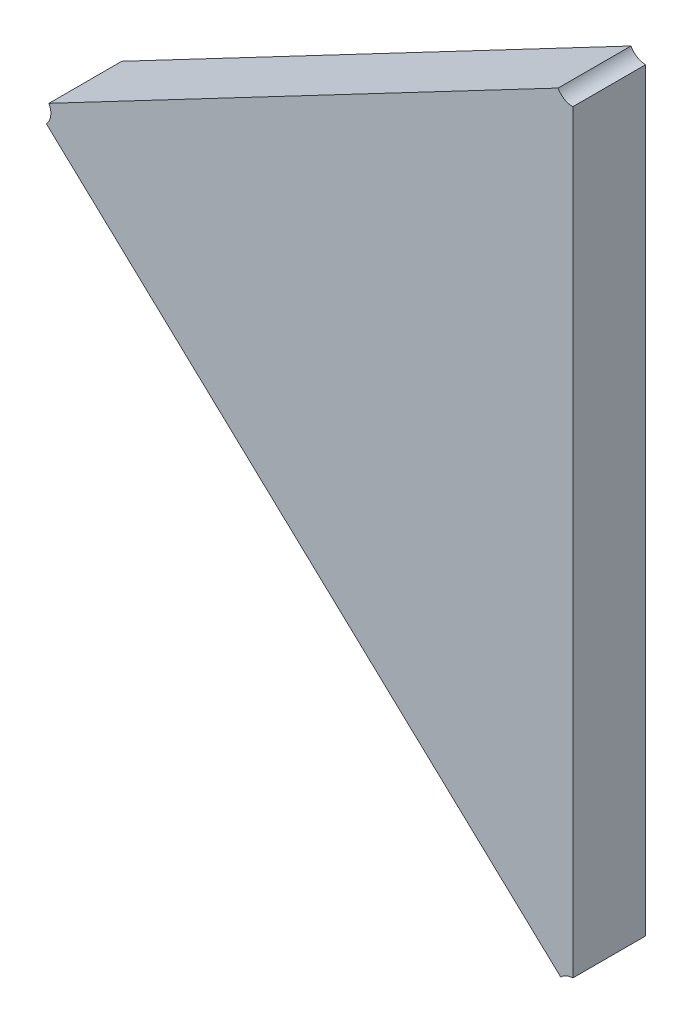
ISO-10303-21;
HEADER;
FILE_DESCRIPTION(('STEP AP214'),'2;1');
FILE_NAME('part.step','',(''),(''),'','','');
FILE_SCHEMA(('AUTOMOTIVE_DESIGN { 1 0 10303 214 1 1 1 1 }'));
ENDSEC;
DATA;
#1=APPLICATION_CONTEXT('core data for automotive mechanical design processes');
#2=APPLICATION_PROTOCOL_DEFINITION('international standard','automotive_design',2000,#1);
#3=PRODUCT_CONTEXT('',#1,'mechanical');
#4=PRODUCT('Part','Part','',(#3));
#5=PRODUCT_RELATED_PRODUCT_CATEGORY('part','',(#4));
#6=PRODUCT_DEFINITION_FORMATION('','',#4);
#7=PRODUCT_DEFINITION_CONTEXT('part definition',#1,'design');
#8=PRODUCT_DEFINITION('design','',#6,#7);
#9=PRODUCT_DEFINITION_SHAPE('','',#8);
#10=(LENGTH_UNIT() NAMED_UNIT(*) SI_UNIT(.MILLI.,.METRE.));
#11=(NAMED_UNIT(*) PLANE_ANGLE_UNIT() SI_UNIT($,.RADIAN.));
#12=(NAMED_UNIT(*) SI_UNIT($,.STERADIAN.) SOLID_ANGLE_UNIT());
#13=UNCERTAINTY_MEASURE_WITH_UNIT(LENGTH_MEASURE(1.E-05),#10,'distance_accuracy_value','');
#14=(GEOMETRIC_REPRESENTATION_CONTEXT(3) GLOBAL_UNCERTAINTY_ASSIGNED_CONTEXT((#13)) GLOBAL_UNIT_ASSIGNED_CONTEXT((#10,
#11,#12)) REPRESENTATION_CONTEXT('',''));
#15=CARTESIAN_POINT('',(0.,0.,0.));
#16=DIRECTION('',(0.,0.,1.));
#17=DIRECTION('',(1.,0.,0.));
#18=AXIS2_PLACEMENT_3D('',#15,#16,#17);
#19=CARTESIAN_POINT('',(-1.3140543489609,-1.308653002537,0.00415));
#20=DIRECTION('',(0.,0.,1.));
#21=DIRECTION('',(1.,0.,0.));
#22=AXIS2_PLACEMENT_3D('',#19,#20,#21);
#23=PLANE('',#22);
#24=CARTESIAN_POINT('',(-1.3063434907431,-1.2918616528766,0.00415));
#25=DIRECTION('',(0.,0.,-1.));
#26=DIRECTION('',(0.885039467737987,0.465515993867086,0.));
#27=AXIS2_PLACEMENT_3D('',#24,#25,#26);
#28=CIRCLE('',#27,0.000750000000000008);
#29=CARTESIAN_POINT('',(-1.3063434907431,-1.2926116528766,0.00415));
#30=VERTEX_POINT('',#29);
#31=CARTESIAN_POINT('',(-1.3070072703439,-1.292210789872,0.00415));
#32=VERTEX_POINT('',#31);
#33=EDGE_CURVE('E11',#30,#32,#28,.T.);
#34=ORIENTED_EDGE('',*,*,#33,.T.);
#35=DIRECTION('',(-0.885039467737862,-0.465515993867324,0.));
#36=VECTOR('',#35,1.);
#37=CARTESIAN_POINT('',(-1.3070072703439,-1.292210789872,0.00415));
#38=LINE('',#37,#36);
#39=CARTESIAN_POINT('',(-1.3300806673264,-1.304347011724,0.00415));
#40=VERTEX_POINT('',#39);
#41=EDGE_CURVE('E24',#32,#40,#38,.T.);
#42=ORIENTED_EDGE('',*,*,#41,.T.);
#43=CARTESIAN_POINT('',(-1.3307444469272,-1.3046961487194,0.00415));
#44=DIRECTION('',(0.,0.,-1.));
#45=DIRECTION('',(-0.729821846781365,0.683637383384377,0.));
#46=AXIS2_PLACEMENT_3D('',#43,#44,#45);
#47=CIRCLE('',#46,0.000750000000000006);
#48=CARTESIAN_POINT('',(-1.3301970805421,-1.3052088767569,0.00415));
#49=VERTEX_POINT('',#48);
#50=EDGE_CURVE('E86',#40,#49,#47,.T.);
#51=ORIENTED_EDGE('',*,*,#50,.T.);
#52=DIRECTION('',(0.72982184678132,-0.683637383384425,0.));
#53=VECTOR('',#52,1.);
#54=CARTESIAN_POINT('',(-1.3301970805421,-1.3052088767569,0.00415));
#55=LINE('',#54,#53);
#56=CARTESIAN_POINT('',(-1.3068908571282,-1.3270402396594,0.00415));
#57=VERTEX_POINT('',#56);
#58=EDGE_CURVE('E107',#49,#57,#55,.T.);
#59=ORIENTED_EDGE('',*,*,#58,.T.);
#60=CARTESIAN_POINT('',(-1.3063434907431,-1.327552967697,0.00415));
#61=DIRECTION('',(0.,0.,-1.));
#62=DIRECTION('',(0.,-1.,0.));
#63=AXIS2_PLACEMENT_3D('',#60,#61,#62);
#64=CIRCLE('',#63,0.000750000000000008);
#65=CARTESIAN_POINT('',(-1.3063434907431,-1.326802967697,0.00415));
#66=VERTEX_POINT('',#65);
#67=EDGE_CURVE('E105',#57,#66,#64,.T.);
#68=ORIENTED_EDGE('',*,*,#67,.T.);
#69=DIRECTION('',(0.,1.,0.));
#70=VECTOR('',#69,1.);
#71=CARTESIAN_POINT('',(-1.3063434907431,-1.326802967697,0.00415));
#72=LINE('',#71,#70);
#73=EDGE_CURVE('E103',#66,#30,#72,.T.);
#74=ORIENTED_EDGE('',*,*,#73,.T.);
#75=EDGE_LOOP('',(#34,#42,#51,#59,#68,#74));
#76=FACE_BOUND('',#75,.T.);
#77=ADVANCED_FACE('F17',(#76),#23,.T.);
#78=CARTESIAN_POINT('',(-1.3140406647502,-1.3086676431187,0.00085));
#79=DIRECTION('',(0.,0.,1.));
#80=DIRECTION('',(1.,0.,0.));
#81=AXIS2_PLACEMENT_3D('',#78,#79,#80);
#82=PLANE('',#81);
#83=CARTESIAN_POINT('',(-1.3063434907431,-1.2918616528766,0.00085));
#84=DIRECTION('',(0.,0.,1.));
#85=DIRECTION('',(-1.,0.,0.));
#86=AXIS2_PLACEMENT_3D('',#83,#84,#85);
#87=CIRCLE('',#86,0.000750000000000008);
#88=CARTESIAN_POINT('',(-1.3070072703439,-1.292210789872,0.00085));
#89=VERTEX_POINT('',#88);
#90=CARTESIAN_POINT('',(-1.3063434907431,-1.2926116528766,0.00085));
#91=VERTEX_POINT('',#90);
#92=EDGE_CURVE('E101',#89,#91,#87,.T.);
#93=ORIENTED_EDGE('',*,*,#92,.T.);
#94=DIRECTION('',(0.,1.,0.));
#95=VECTOR('',#94,1.);
#96=CARTESIAN_POINT('',(-1.3063434907431,-1.327552967697,0.00085));
#97=LINE('',#96,#95);
#98=CARTESIAN_POINT('',(-1.3063434907431,-1.326802967697,0.00085));
#99=VERTEX_POINT('',#98);
#100=EDGE_CURVE('E98',#99,#91,#97,.T.);
#101=ORIENTED_EDGE('',*,*,#100,.F.);
#102=CARTESIAN_POINT('',(-1.3063434907431,-1.327552967697,0.00085));
#103=DIRECTION('',(0.,0.,1.));
#104=DIRECTION('',(-1.,0.,0.));
#105=AXIS2_PLACEMENT_3D('',#102,#103,#104);
#106=CIRCLE('',#105,0.000750000000000008);
#107=CARTESIAN_POINT('',(-1.3068908571282,-1.3270402396594,0.00085));
#108=VERTEX_POINT('',#107);
#109=EDGE_CURVE('E96',#99,#108,#106,.T.);
#110=ORIENTED_EDGE('',*,*,#109,.T.);
#111=DIRECTION('',(0.729821846781321,-0.683637383384425,0.));
#112=VECTOR('',#111,1.);
#113=CARTESIAN_POINT('',(-1.3307444469272,-1.3046961487194,0.00085));
#114=LINE('',#113,#112);
#115=CARTESIAN_POINT('',(-1.3301970805421,-1.3052088767569,0.00085));
#116=VERTEX_POINT('',#115);
#117=EDGE_CURVE('E72',#116,#108,#114,.T.);
#118=ORIENTED_EDGE('',*,*,#117,.F.);
#119=CARTESIAN_POINT('',(-1.3307444469272,-1.3046961487194,0.00085));
#120=DIRECTION('',(0.,0.,1.));
#121=DIRECTION('',(-1.,0.,0.));
#122=AXIS2_PLACEMENT_3D('',#119,#120,#121);
#123=CIRCLE('',#122,0.000750000000000006);
#124=CARTESIAN_POINT('',(-1.3300806673264,-1.304347011724,0.00085));
#125=VERTEX_POINT('',#124);
#126=EDGE_CURVE('E66',#116,#125,#123,.T.);
#127=ORIENTED_EDGE('',*,*,#126,.T.);
#128=DIRECTION('',(-0.885039467737862,-0.465515993867324,0.));
#129=VECTOR('',#128,1.);
#130=CARTESIAN_POINT('',(-1.3063434907431,-1.2918616528766,0.00085));
#131=LINE('',#130,#129);
#132=EDGE_CURVE('E69',#89,#125,#131,.T.);
#133=ORIENTED_EDGE('',*,*,#132,.F.);
#134=EDGE_LOOP('',(#93,#101,#110,#118,#127,#133));
#135=FACE_BOUND('',#134,.T.);
#136=ADVANCED_FACE('F68',(#135),#82,.F.);
#137=CARTESIAN_POINT('',(-1.3063434907431,-1.2918616528766,0.00085));
#138=DIRECTION('',(-0.465515993867324,0.885039467737862,0.));
#139=DIRECTION('',(-0.885039467737862,-0.465515993867324,0.));
#140=AXIS2_PLACEMENT_3D('',#137,#138,#139);
#141=PLANE('',#140);
#142=DIRECTION('',(0.,0.,-1.));
#143=VECTOR('',#142,1.);
#144=CARTESIAN_POINT('',(-1.3070072703439,-1.292210789872,0.00115));
#145=LINE('',#144,#143);
#146=EDGE_CURVE('E82',#32,#89,#145,.T.);
#147=ORIENTED_EDGE('',*,*,#146,.T.);
#148=ORIENTED_EDGE('',*,*,#132,.T.);
#149=DIRECTION('',(0.,0.,1.));
#150=VECTOR('',#149,1.);
#151=CARTESIAN_POINT('',(-1.3300806673264,-1.304347011724,0.00115));
#152=LINE('',#151,#150);
#153=EDGE_CURVE('E81',#125,#40,#152,.T.);
#154=ORIENTED_EDGE('',*,*,#153,.T.);
#155=ORIENTED_EDGE('',*,*,#41,.F.);
#156=EDGE_LOOP('',(#147,#148,#154,#155));
#157=FACE_BOUND('',#156,.T.);
#158=ADVANCED_FACE('F80',(#157),#141,.T.);
#159=CARTESIAN_POINT('',(-1.3307444469272,-1.3046961487194,0.00085));
#160=DIRECTION('',(-0.683637383384425,-0.729821846781321,0.));
#161=DIRECTION('',(0.729821846781321,-0.683637383384425,0.));
#162=AXIS2_PLACEMENT_3D('',#159,#160,#161);
#163=PLANE('',#162);
#164=DIRECTION('',(0.,0.,1.));
#165=VECTOR('',#164,1.);
#166=CARTESIAN_POINT('',(-1.3068908571282,-1.3270402396594,0.00115));
#167=LINE('',#166,#165);
#168=EDGE_CURVE('E87',#108,#57,#167,.T.);
#169=ORIENTED_EDGE('',*,*,#168,.T.);
#170=ORIENTED_EDGE('',*,*,#58,.F.);
#171=DIRECTION('',(0.,0.,-1.));
#172=VECTOR('',#171,1.);
#173=CARTESIAN_POINT('',(-1.3301970805421,-1.3052088767569,0.00115));
#174=LINE('',#173,#172);
#175=EDGE_CURVE('E91',#49,#116,#174,.T.);
#176=ORIENTED_EDGE('',*,*,#175,.T.);
#177=ORIENTED_EDGE('',*,*,#117,.T.);
#178=EDGE_LOOP('',(#169,#170,#176,#177));
#179=FACE_BOUND('',#178,.T.);
#180=ADVANCED_FACE('F125',(#179),#163,.T.);
#181=CARTESIAN_POINT('',(-1.3063434907431,-1.327552967697,0.00085));
#182=DIRECTION('',(1.,0.,0.));
#183=DIRECTION('',(0.,1.,0.));
#184=AXIS2_PLACEMENT_3D('',#181,#182,#183);
#185=PLANE('',#184);
#186=DIRECTION('',(0.,0.,1.));
#187=VECTOR('',#186,1.);
#188=CARTESIAN_POINT('',(-1.3063434907431,-1.2926116528766,0.00115));
#189=LINE('',#188,#187);
#190=EDGE_CURVE('E112',#91,#30,#189,.T.);
#191=ORIENTED_EDGE('',*,*,#190,.T.);
#192=ORIENTED_EDGE('',*,*,#73,.F.);
#193=DIRECTION('',(0.,0.,-1.));
#194=VECTOR('',#193,1.);
#195=CARTESIAN_POINT('',(-1.3063434907431,-1.326802967697,0.00115));
#196=LINE('',#195,#194);
#197=EDGE_CURVE('E119',#66,#99,#196,.T.);
#198=ORIENTED_EDGE('',*,*,#197,.T.);
#199=ORIENTED_EDGE('',*,*,#100,.T.);
#200=EDGE_LOOP('',(#191,#192,#198,#199));
#201=FACE_BOUND('',#200,.T.);
#202=ADVANCED_FACE('F116',(#201),#185,.T.);
#203=CARTESIAN_POINT('',(-1.3307444469272,-1.3046961487194,0.00115));
#204=DIRECTION('',(0.,0.,1.));
#205=DIRECTION('',(0.991000826132335,-0.133855752976965,0.));
#206=AXIS2_PLACEMENT_3D('',#203,#204,#205);
#207=CYLINDRICAL_SURFACE('',#206,0.000750000000000006);
#208=ORIENTED_EDGE('',*,*,#153,.F.);
#209=ORIENTED_EDGE('',*,*,#126,.F.);
#210=ORIENTED_EDGE('',*,*,#175,.F.);
#211=ORIENTED_EDGE('',*,*,#50,.F.);
#212=EDGE_LOOP('',(#208,#209,#210,#211));
#213=FACE_BOUND('',#212,.T.);
#214=ADVANCED_FACE('F85',(#213),#207,.F.);
#215=CARTESIAN_POINT('',(-1.3063434907431,-1.327552967697,0.00115));
#216=DIRECTION('',(0.,0.,1.));
#217=DIRECTION('',(-1.,0.,0.));
#218=AXIS2_PLACEMENT_3D('',#215,#216,#217);
#219=CYLINDRICAL_SURFACE('',#218,0.000750000000000008);
#220=ORIENTED_EDGE('',*,*,#168,.F.);
#221=ORIENTED_EDGE('',*,*,#109,.F.);
#222=ORIENTED_EDGE('',*,*,#197,.F.);
#223=ORIENTED_EDGE('',*,*,#67,.F.);
#224=EDGE_LOOP('',(#220,#221,#222,#223));
#225=FACE_BOUND('',#224,.T.);
#226=ADVANCED_FACE('F127',(#225),#219,.F.);
#227=CARTESIAN_POINT('',(-1.3063434907431,-1.2918616528766,0.00115));
#228=DIRECTION('',(0.,0.,1.));
#229=DIRECTION('',(-1.,0.,0.));
#230=AXIS2_PLACEMENT_3D('',#227,#228,#229);
#231=CYLINDRICAL_SURFACE('',#230,0.000750000000000008);
#232=ORIENTED_EDGE('',*,*,#146,.F.);
#233=ORIENTED_EDGE('',*,*,#33,.F.);
#234=ORIENTED_EDGE('',*,*,#190,.F.);
#235=ORIENTED_EDGE('',*,*,#92,.F.);
#236=EDGE_LOOP('',(#232,#233,#234,#235));
#237=FACE_BOUND('',#236,.T.);
#238=ADVANCED_FACE('F110',(#237),#231,.F.);
#239=CLOSED_SHELL('',(#77,#136,#158,#180,#202,#214,#226,#238));
#240=MANIFOLD_SOLID_BREP('B1',#239);
#241=ADVANCED_BREP_SHAPE_REPRESENTATION('',(#18,#240),#14);
#242=SHAPE_DEFINITION_REPRESENTATION(#9,#241);
ENDSEC;
END-ISO-10303-21;
